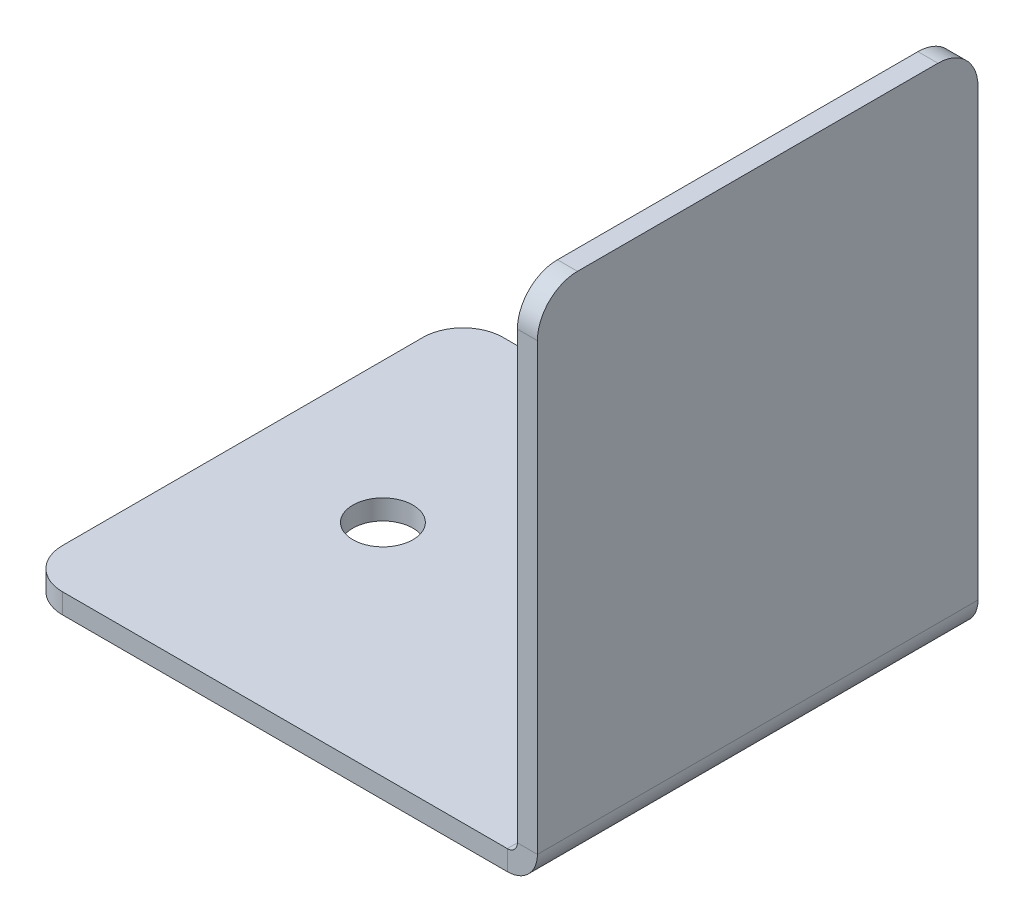
ISO-10303-21;
HEADER;
FILE_DESCRIPTION(('STEP AP214'),'2;1');
FILE_NAME('part.step','',(''),(''),'','','');
FILE_SCHEMA(('AUTOMOTIVE_DESIGN { 1 0 10303 214 1 1 1 1 }'));
ENDSEC;
DATA;
#1=APPLICATION_CONTEXT('core data for automotive mechanical design processes');
#2=APPLICATION_PROTOCOL_DEFINITION('international standard','automotive_design',2000,#1);
#3=PRODUCT_CONTEXT('',#1,'mechanical');
#4=PRODUCT('Part','Part','',(#3));
#5=PRODUCT_RELATED_PRODUCT_CATEGORY('part','',(#4));
#6=PRODUCT_DEFINITION_FORMATION('','',#4);
#7=PRODUCT_DEFINITION_CONTEXT('part definition',#1,'design');
#8=PRODUCT_DEFINITION('design','',#6,#7);
#9=PRODUCT_DEFINITION_SHAPE('','',#8);
#10=(LENGTH_UNIT() NAMED_UNIT(*) SI_UNIT(.MILLI.,.METRE.));
#11=(NAMED_UNIT(*) PLANE_ANGLE_UNIT() SI_UNIT($,.RADIAN.));
#12=(NAMED_UNIT(*) SI_UNIT($,.STERADIAN.) SOLID_ANGLE_UNIT());
#13=UNCERTAINTY_MEASURE_WITH_UNIT(LENGTH_MEASURE(1.E-05),#10,'distance_accuracy_value','');
#14=(GEOMETRIC_REPRESENTATION_CONTEXT(3) GLOBAL_UNCERTAINTY_ASSIGNED_CONTEXT((#13)) GLOBAL_UNIT_ASSIGNED_CONTEXT((#10,
#11,#12)) REPRESENTATION_CONTEXT('',''));
#15=CARTESIAN_POINT('',(0.,0.,0.));
#16=DIRECTION('',(0.,0.,1.));
#17=DIRECTION('',(1.,0.,0.));
#18=AXIS2_PLACEMENT_3D('',#15,#16,#17);
#19=CARTESIAN_POINT('',(0.714601836602544,0.714601836602564,0.));
#20=DIRECTION('',(-1.,0.,0.));
#21=DIRECTION('',(0.,0.,1.));
#22=AXIS2_PLACEMENT_3D('',#19,#20,#21);
#23=PLANE('',#22);
#24=DIRECTION('',(0.,1.,0.));
#25=VECTOR('',#24,1.);
#26=CARTESIAN_POINT('',(0.714601836602551,0.714601836602557,-10.1429525647549));
#27=LINE('',#26,#25);
#28=CARTESIAN_POINT('',(0.71460183660247,23.7146018366026,-10.1429525647549));
#29=VERTEX_POINT('',#28);
#30=CARTESIAN_POINT('',(0.714601836602548,1.50000000000001,-10.1429525647549));
#31=VERTEX_POINT('',#30);
#32=EDGE_CURVE('E232',#29,#31,#27,.F.);
#33=ORIENTED_EDGE('',*,*,#32,.F.);
#34=CARTESIAN_POINT('',(0.714601836602469,23.7146018366026,-8.14295256475492));
#35=DIRECTION('',(-1.,0.,0.));
#36=DIRECTION('',(0.,-1.,0.));
#37=AXIS2_PLACEMENT_3D('',#34,#35,#36);
#38=CIRCLE('',#37,2.);
#39=CARTESIAN_POINT('',(0.714601836602462,25.7146018366026,-8.14295256475492));
#40=VERTEX_POINT('',#39);
#41=EDGE_CURVE('E274',#29,#40,#38,.F.);
#42=ORIENTED_EDGE('',*,*,#41,.T.);
#43=DIRECTION('',(0.,0.,1.));
#44=VECTOR('',#43,1.);
#45=CARTESIAN_POINT('',(0.714601836602457,25.7146018366026,0.));
#46=LINE('',#45,#44);
#47=CARTESIAN_POINT('',(0.714601836602451,25.7146018366026,9.85704743524508));
#48=VERTEX_POINT('',#47);
#49=EDGE_CURVE('E229',#48,#40,#46,.F.);
#50=ORIENTED_EDGE('',*,*,#49,.F.);
#51=CARTESIAN_POINT('',(0.714601836602458,23.7146018366026,9.85704743524508));
#52=DIRECTION('',(-1.,0.,0.));
#53=DIRECTION('',(0.,-1.,0.));
#54=AXIS2_PLACEMENT_3D('',#51,#52,#53);
#55=CIRCLE('',#54,2.);
#56=CARTESIAN_POINT('',(0.714601836602456,23.7146018366026,11.8570474352451));
#57=VERTEX_POINT('',#56);
#58=EDGE_CURVE('E56',#48,#57,#55,.F.);
#59=ORIENTED_EDGE('',*,*,#58,.T.);
#60=DIRECTION('',(0.,1.,0.));
#61=VECTOR('',#60,1.);
#62=CARTESIAN_POINT('',(0.714601836602537,0.714601836602571,11.8570474352451));
#63=LINE('',#62,#61);
#64=CARTESIAN_POINT('',(0.714601836602534,1.50000000000002,11.8570474352451));
#65=VERTEX_POINT('',#64);
#66=EDGE_CURVE('E228',#65,#57,#63,.T.);
#67=ORIENTED_EDGE('',*,*,#66,.F.);
#68=DIRECTION('',(0.,0.,-1.));
#69=VECTOR('',#68,1.);
#70=CARTESIAN_POINT('',(0.714601836602542,1.50000000000002,0.));
#71=LINE('',#70,#69);
#72=EDGE_CURVE('E238',#65,#31,#71,.T.);
#73=ORIENTED_EDGE('',*,*,#72,.T.);
#74=EDGE_LOOP('',(#33,#42,#50,#59,#67,#73));
#75=FACE_BOUND('',#74,.T.);
#76=ADVANCED_FACE('F41',(#75),#23,.F.);
#77=CARTESIAN_POINT('',(-0.285398163397376,-24.2853981633974,11.8570474352451));
#78=DIRECTION('',(0.,0.,1.));
#79=DIRECTION('',(0.,1.,0.));
#80=AXIS2_PLACEMENT_3D('',#77,#78,#79);
#81=PLANE('',#80);
#82=ORIENTED_EDGE('',*,*,#66,.T.);
#83=DIRECTION('',(-1.,0.,0.));
#84=VECTOR('',#83,1.);
#85=CARTESIAN_POINT('',(-0.285398163397543,23.7146018366026,11.8570474352451));
#86=LINE('',#85,#84);
#87=CARTESIAN_POINT('',(-0.285398163397543,23.7146018366026,11.8570474352451));
#88=VERTEX_POINT('',#87);
#89=EDGE_CURVE('E49',#57,#88,#86,.T.);
#90=ORIENTED_EDGE('',*,*,#89,.T.);
#91=DIRECTION('',(0.,1.,0.));
#92=VECTOR('',#91,1.);
#93=CARTESIAN_POINT('',(-0.285398163397376,-24.2853981633974,11.8570474352451));
#94=LINE('',#93,#92);
#95=CARTESIAN_POINT('',(-0.285398163397466,1.50000000000002,11.8570474352451));
#96=VERTEX_POINT('',#95);
#97=EDGE_CURVE('E236',#96,#88,#94,.T.);
#98=ORIENTED_EDGE('',*,*,#97,.F.);
#99=DIRECTION('',(-1.,0.,0.));
#100=VECTOR('',#99,1.);
#101=CARTESIAN_POINT('',(-0.285398163397466,1.50000000000002,11.8570474352451));
#102=LINE('',#101,#100);
#103=EDGE_CURVE('E241',#65,#96,#102,.T.);
#104=ORIENTED_EDGE('',*,*,#103,.F.);
#105=EDGE_LOOP('',(#82,#90,#98,#104));
#106=FACE_BOUND('',#105,.T.);
#107=ADVANCED_FACE('F279',(#106),#81,.T.);
#108=CARTESIAN_POINT('',(-0.285398163397537,25.7146018366026,-10.1429525647549));
#109=DIRECTION('',(0.,1.,0.));
#110=DIRECTION('',(0.,0.,-1.));
#111=AXIS2_PLACEMENT_3D('',#108,#109,#110);
#112=PLANE('',#111);
#113=ORIENTED_EDGE('',*,*,#49,.T.);
#114=DIRECTION('',(-1.,0.,0.));
#115=VECTOR('',#114,1.);
#116=CARTESIAN_POINT('',(-0.285398163397538,25.7146018366026,-8.14295256475492));
#117=LINE('',#116,#115);
#118=CARTESIAN_POINT('',(-0.285398163397538,25.7146018366026,-8.14295256475492));
#119=VERTEX_POINT('',#118);
#120=EDGE_CURVE('E265',#40,#119,#117,.T.);
#121=ORIENTED_EDGE('',*,*,#120,.T.);
#122=DIRECTION('',(0.,0.,-1.));
#123=VECTOR('',#122,1.);
#124=CARTESIAN_POINT('',(-0.285398163397537,25.7146018366026,-10.1429525647549));
#125=LINE('',#124,#123);
#126=CARTESIAN_POINT('',(-0.285398163397549,25.7146018366026,9.85704743524508));
#127=VERTEX_POINT('',#126);
#128=EDGE_CURVE('E224',#127,#119,#125,.T.);
#129=ORIENTED_EDGE('',*,*,#128,.F.);
#130=DIRECTION('',(-1.,0.,0.));
#131=VECTOR('',#130,1.);
#132=CARTESIAN_POINT('',(-0.285398163397549,25.7146018366026,9.85704743524508));
#133=LINE('',#132,#131);
#134=EDGE_CURVE('E263',#127,#48,#133,.F.);
#135=ORIENTED_EDGE('',*,*,#134,.T.);
#136=EDGE_LOOP('',(#113,#121,#129,#135));
#137=FACE_BOUND('',#136,.T.);
#138=ADVANCED_FACE('F377',(#137),#112,.T.);
#139=CARTESIAN_POINT('',(-0.285398163397362,-24.2853981633975,-10.1429525647549));
#140=DIRECTION('',(0.,0.,-1.));
#141=DIRECTION('',(0.,-1.,0.));
#142=AXIS2_PLACEMENT_3D('',#139,#140,#141);
#143=PLANE('',#142);
#144=DIRECTION('',(0.,-1.,0.));
#145=VECTOR('',#144,1.);
#146=CARTESIAN_POINT('',(-0.285398163397362,-24.2853981633975,-10.1429525647549));
#147=LINE('',#146,#145);
#148=CARTESIAN_POINT('',(-0.28539816339753,23.7146018366026,-10.1429525647549));
#149=VERTEX_POINT('',#148);
#150=CARTESIAN_POINT('',(-0.28539816339744,1.5,-10.1429525647549));
#151=VERTEX_POINT('',#150);
#152=EDGE_CURVE('E227',#149,#151,#147,.T.);
#153=ORIENTED_EDGE('',*,*,#152,.F.);
#154=DIRECTION('',(-1.,0.,0.));
#155=VECTOR('',#154,1.);
#156=CARTESIAN_POINT('',(-0.28539816339753,23.7146018366026,-10.1429525647549));
#157=LINE('',#156,#155);
#158=EDGE_CURVE('E64',#149,#29,#157,.F.);
#159=ORIENTED_EDGE('',*,*,#158,.T.);
#160=ORIENTED_EDGE('',*,*,#32,.T.);
#161=DIRECTION('',(1.,0.,0.));
#162=VECTOR('',#161,1.);
#163=CARTESIAN_POINT('',(-0.285398163397452,1.50000000000002,-10.1429525647549));
#164=LINE('',#163,#162);
#165=EDGE_CURVE('E235',#151,#31,#164,.T.);
#166=ORIENTED_EDGE('',*,*,#165,.F.);
#167=EDGE_LOOP('',(#153,#159,#160,#166));
#168=FACE_BOUND('',#167,.T.);
#169=ADVANCED_FACE('F286',(#168),#143,.T.);
#170=CARTESIAN_POINT('',(-0.285398163397456,0.71460183660256,0.));
#171=DIRECTION('',(-1.,0.,0.));
#172=DIRECTION('',(0.,0.,1.));
#173=AXIS2_PLACEMENT_3D('',#170,#171,#172);
#174=PLANE('',#173);
#175=ORIENTED_EDGE('',*,*,#128,.T.);
#176=CARTESIAN_POINT('',(-0.285398163397531,23.7146018366026,-8.14295256475492));
#177=DIRECTION('',(-1.,0.,0.));
#178=DIRECTION('',(0.,-1.,0.));
#179=AXIS2_PLACEMENT_3D('',#176,#177,#178);
#180=CIRCLE('',#179,2.);
#181=EDGE_CURVE('E270',#119,#149,#180,.T.);
#182=ORIENTED_EDGE('',*,*,#181,.T.);
#183=ORIENTED_EDGE('',*,*,#152,.T.);
#184=DIRECTION('',(0.,0.,-1.));
#185=VECTOR('',#184,1.);
#186=CARTESIAN_POINT('',(-0.285398163397459,1.50000000000001,0.));
#187=LINE('',#186,#185);
#188=EDGE_CURVE('E177',#96,#151,#187,.T.);
#189=ORIENTED_EDGE('',*,*,#188,.F.);
#190=ORIENTED_EDGE('',*,*,#97,.T.);
#191=CARTESIAN_POINT('',(-0.285398163397542,23.7146018366026,9.85704743524508));
#192=DIRECTION('',(-1.,0.,0.));
#193=DIRECTION('',(0.,-1.,0.));
#194=AXIS2_PLACEMENT_3D('',#191,#192,#193);
#195=CIRCLE('',#194,2.);
#196=EDGE_CURVE('E268',#88,#127,#195,.T.);
#197=ORIENTED_EDGE('',*,*,#196,.T.);
#198=EDGE_LOOP('',(#175,#182,#183,#189,#190,#197));
#199=FACE_BOUND('',#198,.T.);
#200=ADVANCED_FACE('F283',(#199),#174,.T.);
#201=CARTESIAN_POINT('',(-25.,1.,-10.1429525647549));
#202=DIRECTION('',(-1.,0.,0.));
#203=DIRECTION('',(0.,0.,1.));
#204=AXIS2_PLACEMENT_3D('',#201,#202,#203);
#205=PLANE('',#204);
#206=DIRECTION('',(0.,0.,1.));
#207=VECTOR('',#206,1.);
#208=CARTESIAN_POINT('',(-25.,1.,-10.1429525647549));
#209=LINE('',#208,#207);
#210=CARTESIAN_POINT('',(-25.,1.,-8.14295256475491));
#211=VERTEX_POINT('',#210);
#212=CARTESIAN_POINT('',(-25.,1.,9.85704743524509));
#213=VERTEX_POINT('',#212);
#214=EDGE_CURVE('E167',#211,#213,#209,.T.);
#215=ORIENTED_EDGE('',*,*,#214,.F.);
#216=DIRECTION('',(0.,1.,0.));
#217=VECTOR('',#216,1.);
#218=CARTESIAN_POINT('',(-25.,1.,-8.14295256475491));
#219=LINE('',#218,#217);
#220=CARTESIAN_POINT('',(-25.,0.,-8.14295256475491));
#221=VERTEX_POINT('',#220);
#222=EDGE_CURVE('E257',#211,#221,#219,.F.);
#223=ORIENTED_EDGE('',*,*,#222,.T.);
#224=DIRECTION('',(0.,0.,1.));
#225=VECTOR('',#224,1.);
#226=CARTESIAN_POINT('',(-25.,0.,0.));
#227=LINE('',#226,#225);
#228=CARTESIAN_POINT('',(-25.,0.,9.85704743524509));
#229=VERTEX_POINT('',#228);
#230=EDGE_CURVE('E220',#221,#229,#227,.T.);
#231=ORIENTED_EDGE('',*,*,#230,.T.);
#232=DIRECTION('',(0.,1.,0.));
#233=VECTOR('',#232,1.);
#234=CARTESIAN_POINT('',(-25.,1.,9.85704743524509));
#235=LINE('',#234,#233);
#236=EDGE_CURVE('E254',#229,#213,#235,.T.);
#237=ORIENTED_EDGE('',*,*,#236,.T.);
#238=EDGE_LOOP('',(#215,#223,#231,#237));
#239=FACE_BOUND('',#238,.T.);
#240=ADVANCED_FACE('F325',(#239),#205,.T.);
#241=CARTESIAN_POINT('',(-7.,1.,-0.656961832745848));
#242=DIRECTION('',(0.,1.,0.));
#243=DIRECTION('',(0.,0.,1.));
#244=AXIS2_PLACEMENT_3D('',#241,#242,#243);
#245=CYLINDRICAL_SURFACE('',#244,1.5);
#246=DIRECTION('',(0.,1.,0.));
#247=VECTOR('',#246,1.);
#248=CARTESIAN_POINT('',(-8.48599073200906,1.,-0.45243421998127));
#249=LINE('',#248,#247);
#250=CARTESIAN_POINT('',(-8.48599073200906,0.,-0.45243421998127));
#251=VERTEX_POINT('',#250);
#252=CARTESIAN_POINT('',(-8.48599073200906,1.,-0.45243421998127));
#253=VERTEX_POINT('',#252);
#254=EDGE_CURVE('E213',#251,#253,#249,.T.);
#255=ORIENTED_EDGE('',*,*,#254,.F.);
#256=CARTESIAN_POINT('',(-7.,0.,-0.656961832745848));
#257=DIRECTION('',(0.,1.,0.));
#258=DIRECTION('',(0.,0.,1.));
#259=AXIS2_PLACEMENT_3D('',#256,#257,#258);
#260=CIRCLE('',#259,1.5);
#261=CARTESIAN_POINT('',(-5.51400926799093,0.,-0.861489445510425));
#262=VERTEX_POINT('',#261);
#263=EDGE_CURVE('E309',#262,#251,#260,.T.);
#264=ORIENTED_EDGE('',*,*,#263,.F.);
#265=DIRECTION('',(0.,1.,0.));
#266=VECTOR('',#265,1.);
#267=CARTESIAN_POINT('',(-5.51400926799093,1.,-0.861489445510425));
#268=LINE('',#267,#266);
#269=CARTESIAN_POINT('',(-5.51400926799093,1.,-0.861489445510425));
#270=VERTEX_POINT('',#269);
#271=EDGE_CURVE('E218',#262,#270,#268,.T.);
#272=ORIENTED_EDGE('',*,*,#271,.T.);
#273=CARTESIAN_POINT('',(-7.,1.,-0.656961832745848));
#274=DIRECTION('',(0.,1.,0.));
#275=DIRECTION('',(0.,0.,1.));
#276=AXIS2_PLACEMENT_3D('',#273,#274,#275);
#277=CIRCLE('',#276,1.5);
#278=EDGE_CURVE('E215',#270,#253,#277,.T.);
#279=ORIENTED_EDGE('',*,*,#278,.T.);
#280=EDGE_LOOP('',(#255,#264,#272,#279));
#281=FACE_BOUND('',#280,.T.);
#282=ADVANCED_FACE('F348',(#281),#245,.F.);
#283=CARTESIAN_POINT('',(-18.,1.,0.857047435245093));
#284=DIRECTION('',(0.,-1.,0.));
#285=DIRECTION('',(0.,0.,-1.));
#286=AXIS2_PLACEMENT_3D('',#283,#284,#285);
#287=CYLINDRICAL_SURFACE('',#286,9.60370316892353);
#288=DIRECTION('',(0.,1.,0.));
#289=VECTOR('',#288,1.);
#290=CARTESIAN_POINT('',(-8.48599073200906,1.,2.16652909047146));
#291=LINE('',#290,#289);
#292=CARTESIAN_POINT('',(-8.48599073200906,0.,2.16652909047146));
#293=VERTEX_POINT('',#292);
#294=CARTESIAN_POINT('',(-8.48599073200906,1.,2.16652909047146));
#295=VERTEX_POINT('',#294);
#296=EDGE_CURVE('E208',#293,#295,#291,.T.);
#297=ORIENTED_EDGE('',*,*,#296,.F.);
#298=CARTESIAN_POINT('',(-18.,0.,0.857047435245093));
#299=DIRECTION('',(0.,-1.,0.));
#300=DIRECTION('',(0.,0.,-1.));
#301=AXIS2_PLACEMENT_3D('',#298,#299,#300);
#302=CIRCLE('',#301,9.60370316892353);
#303=EDGE_CURVE('E306',#251,#293,#302,.T.);
#304=ORIENTED_EDGE('',*,*,#303,.F.);
#305=ORIENTED_EDGE('',*,*,#254,.T.);
#306=CARTESIAN_POINT('',(-18.,1.,0.857047435245093));
#307=DIRECTION('',(0.,-1.,0.));
#308=DIRECTION('',(0.,0.,1.));
#309=AXIS2_PLACEMENT_3D('',#306,#307,#308);
#310=CIRCLE('',#309,9.60370316892353);
#311=EDGE_CURVE('E210',#253,#295,#310,.T.);
#312=ORIENTED_EDGE('',*,*,#311,.T.);
#313=EDGE_LOOP('',(#297,#304,#305,#312));
#314=FACE_BOUND('',#313,.T.);
#315=ADVANCED_FACE('F353',(#314),#287,.T.);
#316=CARTESIAN_POINT('',(-7.,1.,2.37105670323603));
#317=DIRECTION('',(0.,1.,0.));
#318=DIRECTION('',(0.,0.,1.));
#319=AXIS2_PLACEMENT_3D('',#316,#317,#318);
#320=CYLINDRICAL_SURFACE('',#319,1.5);
#321=CARTESIAN_POINT('',(-7.,0.,2.37105670323603));
#322=DIRECTION('',(0.,1.,0.));
#323=DIRECTION('',(0.,0.,1.));
#324=AXIS2_PLACEMENT_3D('',#321,#322,#323);
#325=CIRCLE('',#324,1.5);
#326=CARTESIAN_POINT('',(-5.51400926799093,0.,2.57558431600061));
#327=VERTEX_POINT('',#326);
#328=EDGE_CURVE('E303',#293,#327,#325,.T.);
#329=ORIENTED_EDGE('',*,*,#328,.F.);
#330=ORIENTED_EDGE('',*,*,#296,.T.);
#331=CARTESIAN_POINT('',(-7.,1.,2.37105670323603));
#332=DIRECTION('',(0.,1.,0.));
#333=DIRECTION('',(0.,0.,1.));
#334=AXIS2_PLACEMENT_3D('',#331,#332,#333);
#335=CIRCLE('',#334,1.5);
#336=CARTESIAN_POINT('',(-5.51400926799093,1.,2.57558431600061));
#337=VERTEX_POINT('',#336);
#338=EDGE_CURVE('E205',#295,#337,#335,.T.);
#339=ORIENTED_EDGE('',*,*,#338,.T.);
#340=DIRECTION('',(0.,1.,0.));
#341=VECTOR('',#340,1.);
#342=CARTESIAN_POINT('',(-5.51400926799093,1.,2.57558431600061));
#343=LINE('',#342,#341);
#344=EDGE_CURVE('E203',#327,#337,#343,.T.);
#345=ORIENTED_EDGE('',*,*,#344,.F.);
#346=EDGE_LOOP('',(#329,#330,#339,#345));
#347=FACE_BOUND('',#346,.T.);
#348=ADVANCED_FACE('F355',(#347),#320,.F.);
#349=CARTESIAN_POINT('',(-18.,1.,0.857047435245093));
#350=DIRECTION('',(0.,1.,0.));
#351=DIRECTION('',(0.,0.,1.));
#352=AXIS2_PLACEMENT_3D('',#349,#350,#351);
#353=CYLINDRICAL_SURFACE('',#352,12.6037031689235);
#354=ORIENTED_EDGE('',*,*,#271,.F.);
#355=CARTESIAN_POINT('',(-18.,0.,0.857047435245093));
#356=DIRECTION('',(0.,1.,0.));
#357=DIRECTION('',(0.,0.,1.));
#358=AXIS2_PLACEMENT_3D('',#355,#356,#357);
#359=CIRCLE('',#358,12.6037031689235);
#360=EDGE_CURVE('E312',#327,#262,#359,.T.);
#361=ORIENTED_EDGE('',*,*,#360,.F.);
#362=ORIENTED_EDGE('',*,*,#344,.T.);
#363=CARTESIAN_POINT('',(-18.,1.,0.857047435245093));
#364=DIRECTION('',(0.,1.,0.));
#365=DIRECTION('',(0.,0.,1.));
#366=AXIS2_PLACEMENT_3D('',#363,#364,#365);
#367=CIRCLE('',#366,12.6037031689235);
#368=EDGE_CURVE('E200',#337,#270,#367,.T.);
#369=ORIENTED_EDGE('',*,*,#368,.T.);
#370=EDGE_LOOP('',(#354,#361,#362,#369));
#371=FACE_BOUND('',#370,.T.);
#372=ADVANCED_FACE('F358',(#371),#353,.F.);
#373=CARTESIAN_POINT('',(-18.,1.,0.857047435245093));
#374=DIRECTION('',(0.,1.,0.));
#375=DIRECTION('',(0.,0.,1.));
#376=AXIS2_PLACEMENT_3D('',#373,#374,#375);
#377=CYLINDRICAL_SURFACE('',#376,1.5);
#378=CARTESIAN_POINT('',(-18.,1.,0.857047435245093));
#379=DIRECTION('',(0.,1.,0.));
#380=DIRECTION('',(0.,0.,1.));
#381=AXIS2_PLACEMENT_3D('',#378,#379,#380);
#382=CIRCLE('',#381,1.5);
#383=CARTESIAN_POINT('',(-18.,1.,2.35704743524509));
#384=VERTEX_POINT('',#383);
#385=EDGE_CURVE('E197',#384,#384,#382,.T.);
#386=ORIENTED_EDGE('',*,*,#385,.T.);
#387=EDGE_LOOP('',(#386));
#388=FACE_BOUND('',#387,.T.);
#389=CARTESIAN_POINT('',(-18.,0.,0.857047435245093));
#390=DIRECTION('',(0.,1.,0.));
#391=DIRECTION('',(0.,0.,1.));
#392=AXIS2_PLACEMENT_3D('',#389,#390,#391);
#393=CIRCLE('',#392,1.5);
#394=CARTESIAN_POINT('',(-18.,0.,2.35704743524509));
#395=VERTEX_POINT('',#394);
#396=EDGE_CURVE('E315',#395,#395,#393,.T.);
#397=ORIENTED_EDGE('',*,*,#396,.F.);
#398=EDGE_LOOP('',(#397));
#399=FACE_BOUND('',#398,.T.);
#400=ADVANCED_FACE('F361',(#388,#399),#377,.F.);
#401=CARTESIAN_POINT('',(0.,1.,0.));
#402=DIRECTION('',(0.,1.,0.));
#403=DIRECTION('',(0.,0.,1.));
#404=AXIS2_PLACEMENT_3D('',#401,#402,#403);
#405=PLANE('',#404);
#406=ORIENTED_EDGE('',*,*,#385,.F.);
#407=EDGE_LOOP('',(#406));
#408=FACE_BOUND('',#407,.T.);
#409=ORIENTED_EDGE('',*,*,#368,.F.);
#410=ORIENTED_EDGE('',*,*,#338,.F.);
#411=ORIENTED_EDGE('',*,*,#311,.F.);
#412=ORIENTED_EDGE('',*,*,#278,.F.);
#413=EDGE_LOOP('',(#409,#410,#411,#412));
#414=FACE_BOUND('',#413,.T.);
#415=DIRECTION('',(-1.,0.,0.));
#416=VECTOR('',#415,1.);
#417=CARTESIAN_POINT('',(-25.,1.,-10.1429525647549));
#418=LINE('',#417,#416);
#419=CARTESIAN_POINT('',(-0.785398163397448,1.,-10.1429525647549));
#420=VERTEX_POINT('',#419);
#421=CARTESIAN_POINT('',(-23.,1.,-10.1429525647549));
#422=VERTEX_POINT('',#421);
#423=EDGE_CURVE('E184',#420,#422,#418,.T.);
#424=ORIENTED_EDGE('',*,*,#423,.T.);
#425=CARTESIAN_POINT('',(-23.,1.,-8.14295256475491));
#426=DIRECTION('',(0.,1.,0.));
#427=DIRECTION('',(0.,0.,1.));
#428=AXIS2_PLACEMENT_3D('',#425,#426,#427);
#429=CIRCLE('',#428,2.);
#430=EDGE_CURVE('E252',#422,#211,#429,.T.);
#431=ORIENTED_EDGE('',*,*,#430,.T.);
#432=ORIENTED_EDGE('',*,*,#214,.T.);
#433=CARTESIAN_POINT('',(-23.,1.,9.85704743524509));
#434=DIRECTION('',(0.,1.,0.));
#435=DIRECTION('',(0.,0.,1.));
#436=AXIS2_PLACEMENT_3D('',#433,#434,#435);
#437=CIRCLE('',#436,2.);
#438=CARTESIAN_POINT('',(-23.,1.,11.8570474352451));
#439=VERTEX_POINT('',#438);
#440=EDGE_CURVE('E250',#213,#439,#437,.T.);
#441=ORIENTED_EDGE('',*,*,#440,.T.);
#442=DIRECTION('',(1.,0.,0.));
#443=VECTOR('',#442,1.);
#444=CARTESIAN_POINT('',(-25.,1.,11.8570474352451));
#445=LINE('',#444,#443);
#446=CARTESIAN_POINT('',(-0.785398163397462,1.,11.8570474352451));
#447=VERTEX_POINT('',#446);
#448=EDGE_CURVE('E186',#439,#447,#445,.T.);
#449=ORIENTED_EDGE('',*,*,#448,.T.);
#450=DIRECTION('',(0.,0.,-1.));
#451=VECTOR('',#450,1.);
#452=CARTESIAN_POINT('',(-0.785398163397446,1.,0.));
#453=LINE('',#452,#451);
#454=EDGE_CURVE('E175',#447,#420,#453,.T.);
#455=ORIENTED_EDGE('',*,*,#454,.T.);
#456=EDGE_LOOP('',(#424,#431,#432,#441,#449,#455));
#457=FACE_BOUND('',#456,.T.);
#458=ADVANCED_FACE('F183',(#408,#414,#457),#405,.T.);
#459=CARTESIAN_POINT('',(-25.,1.,-10.1429525647549));
#460=DIRECTION('',(0.,0.,-1.));
#461=DIRECTION('',(-1.,0.,0.));
#462=AXIS2_PLACEMENT_3D('',#459,#460,#461);
#463=PLANE('',#462);
#464=DIRECTION('',(1.,0.,0.));
#465=VECTOR('',#464,1.);
#466=CARTESIAN_POINT('',(0.,0.,-10.1429525647549));
#467=LINE('',#466,#465);
#468=CARTESIAN_POINT('',(-0.785398163397447,0.,-10.1429525647549));
#469=VERTEX_POINT('',#468);
#470=CARTESIAN_POINT('',(-23.,0.,-10.1429525647549));
#471=VERTEX_POINT('',#470);
#472=EDGE_CURVE('E166',#469,#471,#467,.F.);
#473=ORIENTED_EDGE('',*,*,#472,.T.);
#474=DIRECTION('',(0.,1.,0.));
#475=VECTOR('',#474,1.);
#476=CARTESIAN_POINT('',(-23.,1.,-10.1429525647549));
#477=LINE('',#476,#475);
#478=EDGE_CURVE('E191',#471,#422,#477,.T.);
#479=ORIENTED_EDGE('',*,*,#478,.T.);
#480=ORIENTED_EDGE('',*,*,#423,.F.);
#481=DIRECTION('',(0.,-1.,0.));
#482=VECTOR('',#481,1.);
#483=CARTESIAN_POINT('',(-0.785398163397441,1.,-10.1429525647549));
#484=LINE('',#483,#482);
#485=EDGE_CURVE('E155',#420,#469,#484,.T.);
#486=ORIENTED_EDGE('',*,*,#485,.T.);
#487=EDGE_LOOP('',(#473,#479,#480,#486));
#488=FACE_BOUND('',#487,.T.);
#489=ADVANCED_FACE('F189',(#488),#463,.T.);
#490=CARTESIAN_POINT('',(0.,0.,0.));
#491=DIRECTION('',(0.,1.,0.));
#492=DIRECTION('',(0.,0.,1.));
#493=AXIS2_PLACEMENT_3D('',#490,#491,#492);
#494=PLANE('',#493);
#495=ORIENTED_EDGE('',*,*,#230,.F.);
#496=CARTESIAN_POINT('',(-23.,0.,-8.14295256475491));
#497=DIRECTION('',(0.,1.,0.));
#498=DIRECTION('',(0.,0.,1.));
#499=AXIS2_PLACEMENT_3D('',#496,#497,#498);
#500=CIRCLE('',#499,2.);
#501=EDGE_CURVE('E261',#221,#471,#500,.F.);
#502=ORIENTED_EDGE('',*,*,#501,.T.);
#503=ORIENTED_EDGE('',*,*,#472,.F.);
#504=DIRECTION('',(0.,0.,-1.));
#505=VECTOR('',#504,1.);
#506=CARTESIAN_POINT('',(-0.785398163397446,0.,0.));
#507=LINE('',#506,#505);
#508=CARTESIAN_POINT('',(-0.785398163397479,0.,11.8570474352451));
#509=VERTEX_POINT('',#508);
#510=EDGE_CURVE('E178',#509,#469,#507,.T.);
#511=ORIENTED_EDGE('',*,*,#510,.F.);
#512=DIRECTION('',(1.,0.,0.));
#513=VECTOR('',#512,1.);
#514=CARTESIAN_POINT('',(0.,0.,11.8570474352451));
#515=LINE('',#514,#513);
#516=CARTESIAN_POINT('',(-23.,0.,11.8570474352451));
#517=VERTEX_POINT('',#516);
#518=EDGE_CURVE('E301',#517,#509,#515,.T.);
#519=ORIENTED_EDGE('',*,*,#518,.F.);
#520=CARTESIAN_POINT('',(-23.,0.,9.85704743524509));
#521=DIRECTION('',(0.,1.,0.));
#522=DIRECTION('',(0.,0.,1.));
#523=AXIS2_PLACEMENT_3D('',#520,#521,#522);
#524=CIRCLE('',#523,2.);
#525=EDGE_CURVE('E259',#517,#229,#524,.F.);
#526=ORIENTED_EDGE('',*,*,#525,.T.);
#527=EDGE_LOOP('',(#495,#502,#503,#511,#519,#526));
#528=FACE_BOUND('',#527,.T.);
#529=ORIENTED_EDGE('',*,*,#396,.T.);
#530=EDGE_LOOP('',(#529));
#531=FACE_BOUND('',#530,.T.);
#532=ORIENTED_EDGE('',*,*,#360,.T.);
#533=ORIENTED_EDGE('',*,*,#263,.T.);
#534=ORIENTED_EDGE('',*,*,#303,.T.);
#535=ORIENTED_EDGE('',*,*,#328,.T.);
#536=EDGE_LOOP('',(#532,#533,#534,#535));
#537=FACE_BOUND('',#536,.T.);
#538=ADVANCED_FACE('F337',(#528,#531,#537),#494,.F.);
#539=CARTESIAN_POINT('',(-25.,1.,11.8570474352451));
#540=DIRECTION('',(0.,0.,1.));
#541=DIRECTION('',(1.,0.,0.));
#542=AXIS2_PLACEMENT_3D('',#539,#540,#541);
#543=PLANE('',#542);
#544=ORIENTED_EDGE('',*,*,#448,.F.);
#545=DIRECTION('',(0.,1.,0.));
#546=VECTOR('',#545,1.);
#547=CARTESIAN_POINT('',(-23.,1.,11.8570474352451));
#548=LINE('',#547,#546);
#549=EDGE_CURVE('E12',#439,#517,#548,.F.);
#550=ORIENTED_EDGE('',*,*,#549,.T.);
#551=ORIENTED_EDGE('',*,*,#518,.T.);
#552=DIRECTION('',(0.,1.,0.));
#553=VECTOR('',#552,1.);
#554=CARTESIAN_POINT('',(-0.785398163397455,1.,11.8570474352451));
#555=LINE('',#554,#553);
#556=EDGE_CURVE('E233',#509,#447,#555,.T.);
#557=ORIENTED_EDGE('',*,*,#556,.T.);
#558=EDGE_LOOP('',(#544,#550,#551,#557));
#559=FACE_BOUND('',#558,.T.);
#560=ADVANCED_FACE('F332',(#559),#543,.T.);
#561=CARTESIAN_POINT('',(-0.785398163397453,1.5,11.8570474352451));
#562=DIRECTION('',(0.,0.,-1.));
#563=DIRECTION('',(-1.,0.,0.));
#564=AXIS2_PLACEMENT_3D('',#561,#562,#563);
#565=PLANE('',#564);
#566=ORIENTED_EDGE('',*,*,#556,.F.);
#567=CARTESIAN_POINT('',(-0.785398163397453,1.5,11.8570474352451));
#568=DIRECTION('',(0.,0.,-1.));
#569=DIRECTION('',(-1.,0.,0.));
#570=AXIS2_PLACEMENT_3D('',#567,#568,#569);
#571=CIRCLE('',#570,1.5);
#572=EDGE_CURVE('E294',#509,#65,#571,.F.);
#573=ORIENTED_EDGE('',*,*,#572,.T.);
#574=ORIENTED_EDGE('',*,*,#103,.T.);
#575=CARTESIAN_POINT('',(-0.785398163397453,1.5,11.8570474352451));
#576=DIRECTION('',(0.,0.,1.));
#577=DIRECTION('',(1.,0.,0.));
#578=AXIS2_PLACEMENT_3D('',#575,#576,#577);
#579=CIRCLE('',#578,0.5);
#580=EDGE_CURVE('E179',#447,#96,#579,.T.);
#581=ORIENTED_EDGE('',*,*,#580,.F.);
#582=EDGE_LOOP('',(#566,#573,#574,#581));
#583=FACE_BOUND('',#582,.T.);
#584=ADVANCED_FACE('F336',(#583),#565,.F.);
#585=CARTESIAN_POINT('',(-0.78539816339744,1.5,-10.1429525647549));
#586=DIRECTION('',(0.,0.,1.));
#587=DIRECTION('',(1.,0.,0.));
#588=AXIS2_PLACEMENT_3D('',#585,#586,#587);
#589=PLANE('',#588);
#590=CARTESIAN_POINT('',(-0.78539816339744,1.5,-10.1429525647549));
#591=DIRECTION('',(0.,0.,-1.));
#592=DIRECTION('',(-1.,0.,0.));
#593=AXIS2_PLACEMENT_3D('',#590,#591,#592);
#594=CIRCLE('',#593,1.5);
#595=EDGE_CURVE('E161',#31,#469,#594,.T.);
#596=ORIENTED_EDGE('',*,*,#595,.T.);
#597=ORIENTED_EDGE('',*,*,#485,.F.);
#598=CARTESIAN_POINT('',(-0.78539816339744,1.5,-10.1429525647549));
#599=DIRECTION('',(0.,0.,-1.));
#600=DIRECTION('',(-1.,0.,0.));
#601=AXIS2_PLACEMENT_3D('',#598,#599,#600);
#602=CIRCLE('',#601,0.5);
#603=EDGE_CURVE('E159',#151,#420,#602,.T.);
#604=ORIENTED_EDGE('',*,*,#603,.F.);
#605=ORIENTED_EDGE('',*,*,#165,.T.);
#606=EDGE_LOOP('',(#596,#597,#604,#605));
#607=FACE_BOUND('',#606,.T.);
#608=ADVANCED_FACE('F157',(#607),#589,.F.);
#609=CARTESIAN_POINT('',(-0.78539816339746,1.5,22.9357113690132));
#610=DIRECTION('',(0.,0.,-1.));
#611=DIRECTION('',(-1.,0.,0.));
#612=AXIS2_PLACEMENT_3D('',#609,#610,#611);
#613=CYLINDRICAL_SURFACE('',#612,0.5);
#614=ORIENTED_EDGE('',*,*,#188,.T.);
#615=ORIENTED_EDGE('',*,*,#603,.T.);
#616=ORIENTED_EDGE('',*,*,#454,.F.);
#617=ORIENTED_EDGE('',*,*,#580,.T.);
#618=EDGE_LOOP('',(#614,#615,#616,#617));
#619=FACE_BOUND('',#618,.T.);
#620=ADVANCED_FACE('F173',(#619),#613,.F.);
#621=CARTESIAN_POINT('',(-0.78539816339746,1.5,22.9357113690132));
#622=DIRECTION('',(0.,0.,-1.));
#623=DIRECTION('',(-1.,0.,0.));
#624=AXIS2_PLACEMENT_3D('',#621,#622,#623);
#625=CYLINDRICAL_SURFACE('',#624,1.5);
#626=ORIENTED_EDGE('',*,*,#72,.F.);
#627=ORIENTED_EDGE('',*,*,#572,.F.);
#628=ORIENTED_EDGE('',*,*,#510,.T.);
#629=ORIENTED_EDGE('',*,*,#595,.F.);
#630=EDGE_LOOP('',(#626,#627,#628,#629));
#631=FACE_BOUND('',#630,.T.);
#632=ADVANCED_FACE('F289',(#631),#625,.T.);
#633=CARTESIAN_POINT('',(-23.,1.,-8.14295256475491));
#634=DIRECTION('',(0.,1.,0.));
#635=DIRECTION('',(0.,0.,1.));
#636=AXIS2_PLACEMENT_3D('',#633,#634,#635);
#637=CYLINDRICAL_SURFACE('',#636,2.);
#638=ORIENTED_EDGE('',*,*,#501,.F.);
#639=ORIENTED_EDGE('',*,*,#222,.F.);
#640=ORIENTED_EDGE('',*,*,#430,.F.);
#641=ORIENTED_EDGE('',*,*,#478,.F.);
#642=EDGE_LOOP('',(#638,#639,#640,#641));
#643=FACE_BOUND('',#642,.T.);
#644=ADVANCED_FACE('F321',(#643),#637,.T.);
#645=CARTESIAN_POINT('',(-0.285398163397531,23.7146018366026,-8.14295256475492));
#646=DIRECTION('',(-1.,0.,0.));
#647=DIRECTION('',(0.,-1.,0.));
#648=AXIS2_PLACEMENT_3D('',#645,#646,#647);
#649=CYLINDRICAL_SURFACE('',#648,2.);
#650=ORIENTED_EDGE('',*,*,#41,.F.);
#651=ORIENTED_EDGE('',*,*,#158,.F.);
#652=ORIENTED_EDGE('',*,*,#181,.F.);
#653=ORIENTED_EDGE('',*,*,#120,.F.);
#654=EDGE_LOOP('',(#650,#651,#652,#653));
#655=FACE_BOUND('',#654,.T.);
#656=ADVANCED_FACE('F384',(#655),#649,.T.);
#657=CARTESIAN_POINT('',(-0.285398163397542,23.7146018366026,9.85704743524508));
#658=DIRECTION('',(-1.,0.,0.));
#659=DIRECTION('',(0.,-1.,0.));
#660=AXIS2_PLACEMENT_3D('',#657,#658,#659);
#661=CYLINDRICAL_SURFACE('',#660,2.);
#662=ORIENTED_EDGE('',*,*,#58,.F.);
#663=ORIENTED_EDGE('',*,*,#134,.F.);
#664=ORIENTED_EDGE('',*,*,#196,.F.);
#665=ORIENTED_EDGE('',*,*,#89,.F.);
#666=EDGE_LOOP('',(#662,#663,#664,#665));
#667=FACE_BOUND('',#666,.T.);
#668=ADVANCED_FACE('F386',(#667),#661,.T.);
#669=CARTESIAN_POINT('',(-23.,1.,9.85704743524509));
#670=DIRECTION('',(0.,1.,0.));
#671=DIRECTION('',(0.,0.,1.));
#672=AXIS2_PLACEMENT_3D('',#669,#670,#671);
#673=CYLINDRICAL_SURFACE('',#672,2.);
#674=ORIENTED_EDGE('',*,*,#525,.F.);
#675=ORIENTED_EDGE('',*,*,#549,.F.);
#676=ORIENTED_EDGE('',*,*,#440,.F.);
#677=ORIENTED_EDGE('',*,*,#236,.F.);
#678=EDGE_LOOP('',(#674,#675,#676,#677));
#679=FACE_BOUND('',#678,.T.);
#680=ADVANCED_FACE('F43',(#679),#673,.T.);
#681=CLOSED_SHELL('',(#76,#107,#138,#169,#200,#240,#282,#315,#348,#372,#400,#458,#489,#538,#560,
#584,#608,#620,#632,#644,#656,#668,#680));
#682=MANIFOLD_SOLID_BREP('B2',#681);
#683=ADVANCED_BREP_SHAPE_REPRESENTATION('',(#18,#682),#14);
#684=SHAPE_DEFINITION_REPRESENTATION(#9,#683);
ENDSEC;
END-ISO-10303-21;
